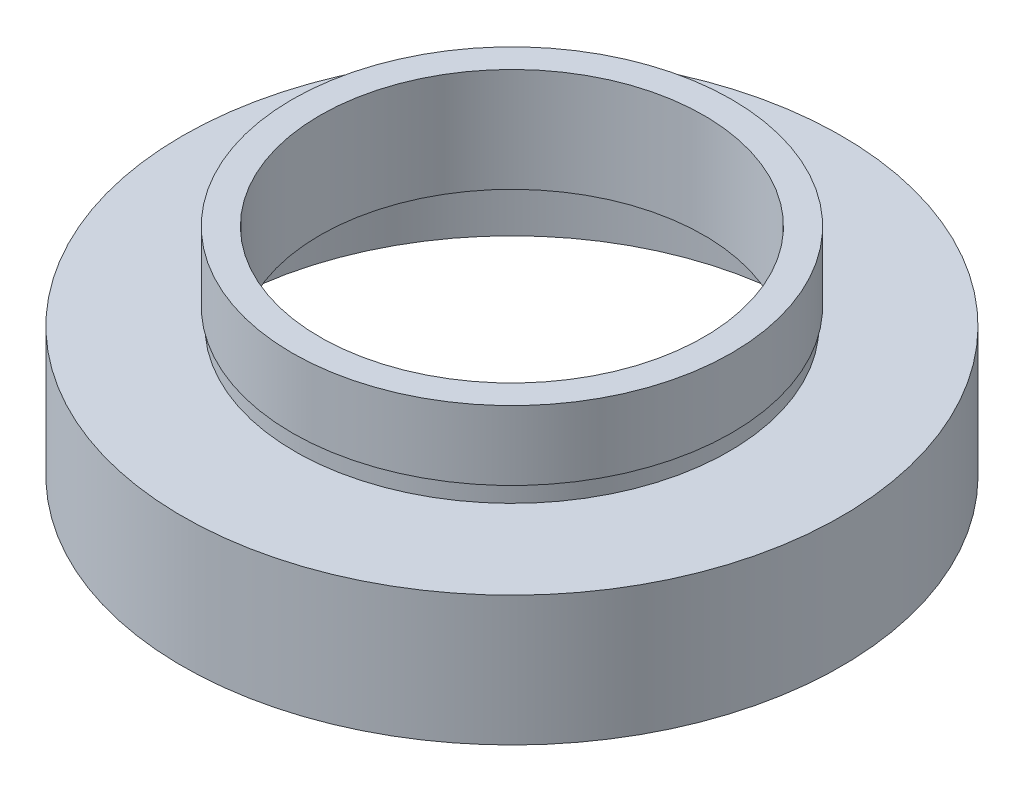
ISO-10303-21;
HEADER;
FILE_DESCRIPTION(('STEP AP214'),'2;1');
FILE_NAME('part.step','',(''),(''),'','','');
FILE_SCHEMA(('AUTOMOTIVE_DESIGN { 1 0 10303 214 1 1 1 1 }'));
ENDSEC;
DATA;
#1=APPLICATION_CONTEXT('core data for automotive mechanical design processes');
#2=APPLICATION_PROTOCOL_DEFINITION('international standard','automotive_design',2000,#1);
#3=PRODUCT_CONTEXT('',#1,'mechanical');
#4=PRODUCT('Part','Part','',(#3));
#5=PRODUCT_RELATED_PRODUCT_CATEGORY('part','',(#4));
#6=PRODUCT_DEFINITION_FORMATION('','',#4);
#7=PRODUCT_DEFINITION_CONTEXT('part definition',#1,'design');
#8=PRODUCT_DEFINITION('design','',#6,#7);
#9=PRODUCT_DEFINITION_SHAPE('','',#8);
#10=(LENGTH_UNIT() NAMED_UNIT(*) SI_UNIT(.MILLI.,.METRE.));
#11=(NAMED_UNIT(*) PLANE_ANGLE_UNIT() SI_UNIT($,.RADIAN.));
#12=(NAMED_UNIT(*) SI_UNIT($,.STERADIAN.) SOLID_ANGLE_UNIT());
#13=UNCERTAINTY_MEASURE_WITH_UNIT(LENGTH_MEASURE(1.E-05),#10,'distance_accuracy_value','');
#14=(GEOMETRIC_REPRESENTATION_CONTEXT(3) GLOBAL_UNCERTAINTY_ASSIGNED_CONTEXT((#13)) GLOBAL_UNIT_ASSIGNED_CONTEXT((#10,
#11,#12)) REPRESENTATION_CONTEXT('',''));
#15=CARTESIAN_POINT('',(0.,0.,0.));
#16=DIRECTION('',(0.,0.,1.));
#17=DIRECTION('',(1.,0.,0.));
#18=AXIS2_PLACEMENT_3D('',#15,#16,#17);
#19=CARTESIAN_POINT('',(19.05,0.,0.));
#20=DIRECTION('',(0.,1.,0.));
#21=DIRECTION('',(-1.,0.,0.));
#22=AXIS2_PLACEMENT_3D('',#19,#20,#21);
#23=PLANE('',#22);
#24=CARTESIAN_POINT('',(0.,0.,0.));
#25=DIRECTION('',(0.,1.,0.));
#26=DIRECTION('',(-1.,0.,0.));
#27=AXIS2_PLACEMENT_3D('',#24,#25,#26);
#28=CIRCLE('',#27,19.05);
#29=CARTESIAN_POINT('',(-19.05,0.,0.));
#30=VERTEX_POINT('',#29);
#31=EDGE_CURVE('E75',#30,#30,#28,.T.);
#32=ORIENTED_EDGE('',*,*,#31,.F.);
#33=EDGE_LOOP('',(#32));
#34=FACE_BOUND('',#33,.T.);
#35=CARTESIAN_POINT('',(0.,0.,0.));
#36=DIRECTION('',(0.,1.,0.));
#37=DIRECTION('',(-1.,0.,0.));
#38=AXIS2_PLACEMENT_3D('',#35,#36,#37);
#39=CIRCLE('',#38,17.);
#40=CARTESIAN_POINT('',(-17.,0.,0.));
#41=VERTEX_POINT('',#40);
#42=EDGE_CURVE('E10',#41,#41,#39,.T.);
#43=ORIENTED_EDGE('',*,*,#42,.T.);
#44=EDGE_LOOP('',(#43));
#45=FACE_BOUND('',#44,.T.);
#46=ADVANCED_FACE('F35',(#34,#45),#23,.F.);
#47=CARTESIAN_POINT('',(0.,16.8860182370821,0.));
#48=DIRECTION('',(0.,1.,0.));
#49=DIRECTION('',(-1.,0.,0.));
#50=AXIS2_PLACEMENT_3D('',#47,#48,#49);
#51=CYLINDRICAL_SURFACE('',#50,17.);
#52=ORIENTED_EDGE('',*,*,#42,.F.);
#53=EDGE_LOOP('',(#52));
#54=FACE_BOUND('',#53,.T.);
#55=CARTESIAN_POINT('',(0.,5.5,0.));
#56=DIRECTION('',(0.,1.,0.));
#57=DIRECTION('',(-1.,0.,0.));
#58=AXIS2_PLACEMENT_3D('',#55,#56,#57);
#59=CIRCLE('',#58,17.);
#60=CARTESIAN_POINT('',(-17.,5.5,0.));
#61=VERTEX_POINT('',#60);
#62=EDGE_CURVE('E41',#61,#61,#59,.T.);
#63=ORIENTED_EDGE('',*,*,#62,.T.);
#64=EDGE_LOOP('',(#63));
#65=FACE_BOUND('',#64,.T.);
#66=ADVANCED_FACE('F82',(#54,#65),#51,.F.);
#67=CARTESIAN_POINT('',(17.,5.5,0.));
#68=DIRECTION('',(0.,-1.,0.));
#69=DIRECTION('',(1.,0.,0.));
#70=AXIS2_PLACEMENT_3D('',#67,#68,#69);
#71=PLANE('',#70);
#72=ORIENTED_EDGE('',*,*,#62,.F.);
#73=EDGE_LOOP('',(#72));
#74=FACE_BOUND('',#73,.T.);
#75=CARTESIAN_POINT('',(0.,5.5,0.));
#76=DIRECTION('',(0.,1.,0.));
#77=DIRECTION('',(-1.,0.,0.));
#78=AXIS2_PLACEMENT_3D('',#75,#76,#77);
#79=CIRCLE('',#78,17.6);
#80=CARTESIAN_POINT('',(-17.6,5.49999999999999,0.));
#81=VERTEX_POINT('',#80);
#82=EDGE_CURVE('E45',#81,#81,#79,.T.);
#83=ORIENTED_EDGE('',*,*,#82,.T.);
#84=EDGE_LOOP('',(#83));
#85=FACE_BOUND('',#84,.T.);
#86=ADVANCED_FACE('F86',(#74,#85),#71,.F.);
#87=CARTESIAN_POINT('',(0.,16.8860182370821,0.));
#88=DIRECTION('',(0.,1.,0.));
#89=DIRECTION('',(-1.,0.,0.));
#90=AXIS2_PLACEMENT_3D('',#87,#88,#89);
#91=CYLINDRICAL_SURFACE('',#90,17.6);
#92=ORIENTED_EDGE('',*,*,#82,.F.);
#93=EDGE_LOOP('',(#92));
#94=FACE_BOUND('',#93,.T.);
#95=CARTESIAN_POINT('',(0.,6.5,0.));
#96=DIRECTION('',(0.,1.,0.));
#97=DIRECTION('',(-1.,0.,0.));
#98=AXIS2_PLACEMENT_3D('',#95,#96,#97);
#99=CIRCLE('',#98,17.6);
#100=CARTESIAN_POINT('',(-17.6,6.5,0.));
#101=VERTEX_POINT('',#100);
#102=EDGE_CURVE('E49',#101,#101,#99,.T.);
#103=ORIENTED_EDGE('',*,*,#102,.T.);
#104=EDGE_LOOP('',(#103));
#105=FACE_BOUND('',#104,.T.);
#106=ADVANCED_FACE('F91',(#94,#105),#91,.F.);
#107=CARTESIAN_POINT('',(11.1,6.5,0.));
#108=DIRECTION('',(0.,1.,0.));
#109=DIRECTION('',(-1.,0.,0.));
#110=AXIS2_PLACEMENT_3D('',#107,#108,#109);
#111=PLANE('',#110);
#112=ORIENTED_EDGE('',*,*,#102,.F.);
#113=EDGE_LOOP('',(#112));
#114=FACE_BOUND('',#113,.T.);
#115=CARTESIAN_POINT('',(0.,6.5,0.));
#116=DIRECTION('',(0.,1.,0.));
#117=DIRECTION('',(-1.,0.,0.));
#118=AXIS2_PLACEMENT_3D('',#115,#116,#117);
#119=CIRCLE('',#118,11.1);
#120=CARTESIAN_POINT('',(-11.1,6.5,0.));
#121=VERTEX_POINT('',#120);
#122=EDGE_CURVE('E54',#121,#121,#119,.T.);
#123=ORIENTED_EDGE('',*,*,#122,.T.);
#124=EDGE_LOOP('',(#123));
#125=FACE_BOUND('',#124,.T.);
#126=ADVANCED_FACE('F97',(#114,#125),#111,.F.);
#127=CARTESIAN_POINT('',(0.,16.8860182370821,0.));
#128=DIRECTION('',(0.,1.,0.));
#129=DIRECTION('',(-1.,0.,0.));
#130=AXIS2_PLACEMENT_3D('',#127,#128,#129);
#131=CYLINDRICAL_SURFACE('',#130,11.1);
#132=ORIENTED_EDGE('',*,*,#122,.F.);
#133=EDGE_LOOP('',(#132));
#134=FACE_BOUND('',#133,.T.);
#135=CARTESIAN_POINT('',(0.,12.5,0.));
#136=DIRECTION('',(0.,1.,0.));
#137=DIRECTION('',(-1.,0.,0.));
#138=AXIS2_PLACEMENT_3D('',#135,#136,#137);
#139=CIRCLE('',#138,11.1);
#140=CARTESIAN_POINT('',(-11.1,12.5,0.));
#141=VERTEX_POINT('',#140);
#142=EDGE_CURVE('E57',#141,#141,#139,.T.);
#143=ORIENTED_EDGE('',*,*,#142,.T.);
#144=EDGE_LOOP('',(#143));
#145=FACE_BOUND('',#144,.T.);
#146=ADVANCED_FACE('F101',(#134,#145),#131,.F.);
#147=CARTESIAN_POINT('',(11.1,12.5,0.));
#148=DIRECTION('',(0.,-1.,0.));
#149=DIRECTION('',(1.,0.,0.));
#150=AXIS2_PLACEMENT_3D('',#147,#148,#149);
#151=PLANE('',#150);
#152=ORIENTED_EDGE('',*,*,#142,.F.);
#153=EDGE_LOOP('',(#152));
#154=FACE_BOUND('',#153,.T.);
#155=CARTESIAN_POINT('',(0.,12.5,0.));
#156=DIRECTION('',(0.,1.,0.));
#157=DIRECTION('',(-1.,0.,0.));
#158=AXIS2_PLACEMENT_3D('',#155,#156,#157);
#159=CIRCLE('',#158,12.7);
#160=CARTESIAN_POINT('',(-12.7,12.5,0.));
#161=VERTEX_POINT('',#160);
#162=EDGE_CURVE('E60',#161,#161,#159,.T.);
#163=ORIENTED_EDGE('',*,*,#162,.T.);
#164=EDGE_LOOP('',(#163));
#165=FACE_BOUND('',#164,.T.);
#166=ADVANCED_FACE('F105',(#154,#165),#151,.F.);
#167=CARTESIAN_POINT('',(0.,16.8860182370821,0.));
#168=DIRECTION('',(0.,1.,0.));
#169=DIRECTION('',(-1.,0.,0.));
#170=AXIS2_PLACEMENT_3D('',#167,#168,#169);
#171=CYLINDRICAL_SURFACE('',#170,12.7);
#172=ORIENTED_EDGE('',*,*,#162,.F.);
#173=EDGE_LOOP('',(#172));
#174=FACE_BOUND('',#173,.T.);
#175=CARTESIAN_POINT('',(0.,8.5,0.));
#176=DIRECTION('',(0.,1.,0.));
#177=DIRECTION('',(-1.,0.,0.));
#178=AXIS2_PLACEMENT_3D('',#175,#176,#177);
#179=CIRCLE('',#178,12.7);
#180=CARTESIAN_POINT('',(-12.7,8.5,0.));
#181=VERTEX_POINT('',#180);
#182=EDGE_CURVE('E63',#181,#181,#179,.T.);
#183=ORIENTED_EDGE('',*,*,#182,.T.);
#184=EDGE_LOOP('',(#183));
#185=FACE_BOUND('',#184,.T.);
#186=ADVANCED_FACE('F109',(#174,#185),#171,.T.);
#187=CARTESIAN_POINT('',(12.7,8.5,0.));
#188=DIRECTION('',(0.,1.,0.));
#189=DIRECTION('',(-1.,0.,0.));
#190=AXIS2_PLACEMENT_3D('',#187,#188,#189);
#191=PLANE('',#190);
#192=ORIENTED_EDGE('',*,*,#182,.F.);
#193=EDGE_LOOP('',(#192));
#194=FACE_BOUND('',#193,.T.);
#195=CARTESIAN_POINT('',(0.,8.5,0.));
#196=DIRECTION('',(0.,1.,0.));
#197=DIRECTION('',(-1.,0.,0.));
#198=AXIS2_PLACEMENT_3D('',#195,#196,#197);
#199=CIRCLE('',#198,12.55);
#200=CARTESIAN_POINT('',(-12.55,8.5,0.));
#201=VERTEX_POINT('',#200);
#202=EDGE_CURVE('E66',#201,#201,#199,.T.);
#203=ORIENTED_EDGE('',*,*,#202,.T.);
#204=EDGE_LOOP('',(#203));
#205=FACE_BOUND('',#204,.T.);
#206=ADVANCED_FACE('F113',(#194,#205),#191,.F.);
#207=CARTESIAN_POINT('',(0.,16.8860182370821,0.));
#208=DIRECTION('',(0.,1.,0.));
#209=DIRECTION('',(-1.,0.,0.));
#210=AXIS2_PLACEMENT_3D('',#207,#208,#209);
#211=CYLINDRICAL_SURFACE('',#210,12.55);
#212=ORIENTED_EDGE('',*,*,#202,.F.);
#213=EDGE_LOOP('',(#212));
#214=FACE_BOUND('',#213,.T.);
#215=CARTESIAN_POINT('',(0.,7.5,0.));
#216=DIRECTION('',(0.,1.,0.));
#217=DIRECTION('',(-1.,0.,0.));
#218=AXIS2_PLACEMENT_3D('',#215,#216,#217);
#219=CIRCLE('',#218,12.55);
#220=CARTESIAN_POINT('',(-12.55,7.5,0.));
#221=VERTEX_POINT('',#220);
#222=EDGE_CURVE('E69',#221,#221,#219,.T.);
#223=ORIENTED_EDGE('',*,*,#222,.T.);
#224=EDGE_LOOP('',(#223));
#225=FACE_BOUND('',#224,.T.);
#226=ADVANCED_FACE('F117',(#214,#225),#211,.T.);
#227=CARTESIAN_POINT('',(12.55,7.5,0.));
#228=DIRECTION('',(0.,-1.,0.));
#229=DIRECTION('',(1.,0.,0.));
#230=AXIS2_PLACEMENT_3D('',#227,#228,#229);
#231=PLANE('',#230);
#232=ORIENTED_EDGE('',*,*,#222,.F.);
#233=EDGE_LOOP('',(#232));
#234=FACE_BOUND('',#233,.T.);
#235=CARTESIAN_POINT('',(0.,7.5,0.));
#236=DIRECTION('',(0.,1.,0.));
#237=DIRECTION('',(-1.,0.,0.));
#238=AXIS2_PLACEMENT_3D('',#235,#236,#237);
#239=CIRCLE('',#238,19.05);
#240=CARTESIAN_POINT('',(-19.05,7.5,0.));
#241=VERTEX_POINT('',#240);
#242=EDGE_CURVE('E72',#241,#241,#239,.T.);
#243=ORIENTED_EDGE('',*,*,#242,.T.);
#244=EDGE_LOOP('',(#243));
#245=FACE_BOUND('',#244,.T.);
#246=ADVANCED_FACE('F121',(#234,#245),#231,.F.);
#247=CARTESIAN_POINT('',(0.,16.8860182370821,0.));
#248=DIRECTION('',(0.,1.,0.));
#249=DIRECTION('',(-1.,0.,0.));
#250=AXIS2_PLACEMENT_3D('',#247,#248,#249);
#251=CYLINDRICAL_SURFACE('',#250,19.05);
#252=ORIENTED_EDGE('',*,*,#242,.F.);
#253=EDGE_LOOP('',(#252));
#254=FACE_BOUND('',#253,.T.);
#255=ORIENTED_EDGE('',*,*,#31,.T.);
#256=EDGE_LOOP('',(#255));
#257=FACE_BOUND('',#256,.T.);
#258=ADVANCED_FACE('F79',(#254,#257),#251,.T.);
#259=CLOSED_SHELL('',(#46,#66,#86,#106,#126,#146,#166,#186,#206,#226,#246,#258));
#260=MANIFOLD_SOLID_BREP('B2',#259);
#261=ADVANCED_BREP_SHAPE_REPRESENTATION('',(#18,#260),#14);
#262=SHAPE_DEFINITION_REPRESENTATION(#9,#261);
ENDSEC;
END-ISO-10303-21;
